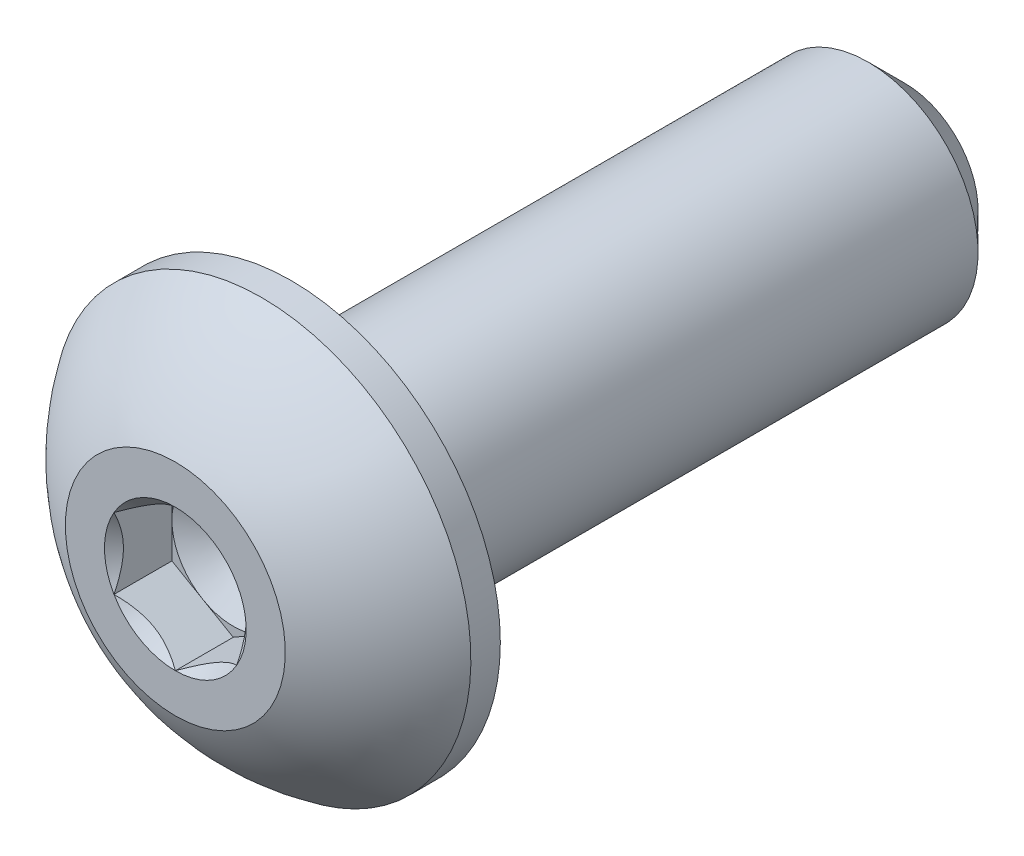
ISO-10303-21;
HEADER;
FILE_DESCRIPTION(('STEP AP214'),'2;1');
FILE_NAME('part.step','',(''),(''),'','','');
FILE_SCHEMA(('AUTOMOTIVE_DESIGN { 1 0 10303 214 1 1 1 1 }'));
ENDSEC;
DATA;
#1=APPLICATION_CONTEXT('core data for automotive mechanical design processes');
#2=APPLICATION_PROTOCOL_DEFINITION('international standard','automotive_design',2000,#1);
#3=PRODUCT_CONTEXT('',#1,'mechanical');
#4=PRODUCT('Part','Part','',(#3));
#5=PRODUCT_RELATED_PRODUCT_CATEGORY('part','',(#4));
#6=PRODUCT_DEFINITION_FORMATION('','',#4);
#7=PRODUCT_DEFINITION_CONTEXT('part definition',#1,'design');
#8=PRODUCT_DEFINITION('design','',#6,#7);
#9=PRODUCT_DEFINITION_SHAPE('','',#8);
#10=(LENGTH_UNIT() NAMED_UNIT(*) SI_UNIT(.MILLI.,.METRE.));
#11=(NAMED_UNIT(*) PLANE_ANGLE_UNIT() SI_UNIT($,.RADIAN.));
#12=(NAMED_UNIT(*) SI_UNIT($,.STERADIAN.) SOLID_ANGLE_UNIT());
#13=UNCERTAINTY_MEASURE_WITH_UNIT(LENGTH_MEASURE(1.E-05),#10,'distance_accuracy_value','');
#14=(GEOMETRIC_REPRESENTATION_CONTEXT(3) GLOBAL_UNCERTAINTY_ASSIGNED_CONTEXT((#13)) GLOBAL_UNIT_ASSIGNED_CONTEXT((#10,
#11,#12)) REPRESENTATION_CONTEXT('',''));
#15=CARTESIAN_POINT('',(0.,0.,0.));
#16=DIRECTION('',(0.,0.,1.));
#17=DIRECTION('',(1.,0.,0.));
#18=AXIS2_PLACEMENT_3D('',#15,#16,#17);
#19=CARTESIAN_POINT('',(0.79375,-1.3748153285078,0.7493));
#20=DIRECTION('',(0.,0.,1.));
#21=DIRECTION('',(1.,0.,0.));
#22=AXIS2_PLACEMENT_3D('',#19,#20,#21);
#23=PLANE('',#22);
#24=CARTESIAN_POINT('',(0.,0.,0.7493));
#25=DIRECTION('',(0.,0.,1.));
#26=DIRECTION('',(1.,0.,0.));
#27=AXIS2_PLACEMENT_3D('',#24,#25,#26);
#28=CIRCLE('',#27,0.79375);
#29=CARTESIAN_POINT('',(0.79375,0.,0.7493));
#30=VERTEX_POINT('',#29);
#31=CARTESIAN_POINT('',(0.396875,0.687407664253898,0.7493));
#32=VERTEX_POINT('',#31);
#33=EDGE_CURVE('E42',#30,#32,#28,.T.);
#34=ORIENTED_EDGE('',*,*,#33,.F.);
#35=DIRECTION('',(0.,1.,0.));
#36=VECTOR('',#35,1.);
#37=CARTESIAN_POINT('',(0.79375,-0.458271776169264,0.7493));
#38=LINE('',#37,#36);
#39=CARTESIAN_POINT('',(0.79375,0.458271776169267,0.7493));
#40=VERTEX_POINT('',#39);
#41=EDGE_CURVE('E112',#30,#40,#38,.T.);
#42=ORIENTED_EDGE('',*,*,#41,.T.);
#43=DIRECTION('',(-0.866025403784438,0.5,0.));
#44=VECTOR('',#43,1.);
#45=CARTESIAN_POINT('',(0.79375,0.458271776169267,0.7493));
#46=LINE('',#45,#44);
#47=EDGE_CURVE('E115',#40,#32,#46,.T.);
#48=ORIENTED_EDGE('',*,*,#47,.T.);
#49=EDGE_LOOP('',(#34,#42,#48));
#50=FACE_BOUND('',#49,.T.);
#51=ADVANCED_FACE('F31',(#50),#23,.T.);
#52=CARTESIAN_POINT('',(-0.396875,0.687407664253899,0.7493));
#53=VERTEX_POINT('',#52);
#54=EDGE_CURVE('E11',#32,#53,#28,.T.);
#55=ORIENTED_EDGE('',*,*,#54,.F.);
#56=CARTESIAN_POINT('',(0.,0.916543552338533,0.7493));
#57=VERTEX_POINT('',#56);
#58=EDGE_CURVE('E129',#32,#57,#46,.T.);
#59=ORIENTED_EDGE('',*,*,#58,.T.);
#60=DIRECTION('',(-0.866025403784439,-0.5,0.));
#61=VECTOR('',#60,1.);
#62=CARTESIAN_POINT('',(0.,0.916543552338533,0.7493));
#63=LINE('',#62,#61);
#64=EDGE_CURVE('E135',#57,#53,#63,.T.);
#65=ORIENTED_EDGE('',*,*,#64,.T.);
#66=EDGE_LOOP('',(#55,#59,#65));
#67=FACE_BOUND('',#66,.T.);
#68=ADVANCED_FACE('F191',(#67),#23,.T.);
#69=CARTESIAN_POINT('',(-0.79375,0.,0.7493));
#70=VERTEX_POINT('',#69);
#71=EDGE_CURVE('E40',#53,#70,#28,.T.);
#72=ORIENTED_EDGE('',*,*,#71,.F.);
#73=CARTESIAN_POINT('',(-0.79375,0.458271776169267,0.7493));
#74=VERTEX_POINT('',#73);
#75=EDGE_CURVE('E134',#53,#74,#63,.T.);
#76=ORIENTED_EDGE('',*,*,#75,.T.);
#77=DIRECTION('',(0.,-1.,0.));
#78=VECTOR('',#77,1.);
#79=CARTESIAN_POINT('',(-0.79375,0.458271776169267,0.7493));
#80=LINE('',#79,#78);
#81=EDGE_CURVE('E139',#74,#70,#80,.T.);
#82=ORIENTED_EDGE('',*,*,#81,.T.);
#83=EDGE_LOOP('',(#72,#76,#82));
#84=FACE_BOUND('',#83,.T.);
#85=ADVANCED_FACE('F196',(#84),#23,.T.);
#86=CARTESIAN_POINT('',(-0.396875,-0.687407664253898,0.7493));
#87=VERTEX_POINT('',#86);
#88=EDGE_CURVE('E226',#70,#87,#28,.T.);
#89=ORIENTED_EDGE('',*,*,#88,.F.);
#90=CARTESIAN_POINT('',(-0.79375,-0.458271776169264,0.7493));
#91=VERTEX_POINT('',#90);
#92=EDGE_CURVE('E138',#70,#91,#80,.T.);
#93=ORIENTED_EDGE('',*,*,#92,.T.);
#94=DIRECTION('',(0.866025403784439,-0.5,0.));
#95=VECTOR('',#94,1.);
#96=CARTESIAN_POINT('',(-0.79375,-0.458271776169264,0.7493));
#97=LINE('',#96,#95);
#98=EDGE_CURVE('E231',#91,#87,#97,.T.);
#99=ORIENTED_EDGE('',*,*,#98,.T.);
#100=EDGE_LOOP('',(#89,#93,#99));
#101=FACE_BOUND('',#100,.T.);
#102=ADVANCED_FACE('F214',(#101),#23,.T.);
#103=CARTESIAN_POINT('',(0.396874999999999,-0.687407664253897,0.7493));
#104=VERTEX_POINT('',#103);
#105=EDGE_CURVE('E49',#87,#104,#28,.T.);
#106=ORIENTED_EDGE('',*,*,#105,.F.);
#107=CARTESIAN_POINT('',(0.,-0.916543552338529,0.7493));
#108=VERTEX_POINT('',#107);
#109=EDGE_CURVE('E223',#87,#108,#97,.T.);
#110=ORIENTED_EDGE('',*,*,#109,.T.);
#111=DIRECTION('',(0.866025403784439,0.5,0.));
#112=VECTOR('',#111,1.);
#113=CARTESIAN_POINT('',(0.,-0.916543552338529,0.7493));
#114=LINE('',#113,#112);
#115=EDGE_CURVE('E124',#108,#104,#114,.T.);
#116=ORIENTED_EDGE('',*,*,#115,.T.);
#117=EDGE_LOOP('',(#106,#110,#116));
#118=FACE_BOUND('',#117,.T.);
#119=ADVANCED_FACE('F203',(#118),#23,.T.);
#120=CARTESIAN_POINT('',(0.,0.,0.));
#121=DIRECTION('',(0.,0.,-1.));
#122=DIRECTION('',(0.,1.,0.));
#123=AXIS2_PLACEMENT_3D('',#120,#121,#122);
#124=CYLINDRICAL_SURFACE('',#123,1.4224);
#125=CARTESIAN_POINT('',(0.,0.,-7.46125));
#126=DIRECTION('',(0.,0.,-1.));
#127=DIRECTION('',(0.,1.,0.));
#128=AXIS2_PLACEMENT_3D('',#125,#126,#127);
#129=CIRCLE('',#128,1.4224);
#130=CARTESIAN_POINT('',(0.,1.4224,-7.46125));
#131=VERTEX_POINT('',#130);
#132=EDGE_CURVE('E35',#131,#131,#129,.F.);
#133=ORIENTED_EDGE('',*,*,#132,.T.);
#134=EDGE_LOOP('',(#133));
#135=FACE_BOUND('',#134,.T.);
#136=CARTESIAN_POINT('',(0.,0.,0.));
#137=DIRECTION('',(0.,0.,1.));
#138=DIRECTION('',(1.,0.,0.));
#139=AXIS2_PLACEMENT_3D('',#136,#137,#138);
#140=CIRCLE('',#139,1.4224);
#141=CARTESIAN_POINT('',(1.4224,0.,0.));
#142=VERTEX_POINT('',#141);
#143=EDGE_CURVE('E166',#142,#142,#140,.F.);
#144=ORIENTED_EDGE('',*,*,#143,.T.);
#145=EDGE_LOOP('',(#144));
#146=FACE_BOUND('',#145,.T.);
#147=ADVANCED_FACE('F175',(#135,#146),#124,.T.);
#148=CARTESIAN_POINT('',(0.,0.,-7.9375));
#149=DIRECTION('',(0.,0.,-1.));
#150=DIRECTION('',(0.,1.,0.));
#151=AXIS2_PLACEMENT_3D('',#148,#149,#150);
#152=PLANE('',#151);
#153=CARTESIAN_POINT('',(0.,0.,-7.9375));
#154=DIRECTION('',(0.,0.,-1.));
#155=DIRECTION('',(0.,1.,0.));
#156=AXIS2_PLACEMENT_3D('',#153,#154,#155);
#157=CIRCLE('',#156,0.94615);
#158=CARTESIAN_POINT('',(0.,0.946150000000001,-7.9375));
#159=VERTEX_POINT('',#158);
#160=EDGE_CURVE('E168',#159,#159,#157,.T.);
#161=ORIENTED_EDGE('',*,*,#160,.T.);
#162=EDGE_LOOP('',(#161));
#163=FACE_BOUND('',#162,.T.);
#164=ADVANCED_FACE('F181',(#163),#152,.T.);
#165=CARTESIAN_POINT('',(0.,0.,-7.9375));
#166=DIRECTION('',(0.,0.,1.));
#167=DIRECTION('',(0.,-1.,0.));
#168=AXIS2_PLACEMENT_3D('',#165,#166,#167);
#169=CONICAL_SURFACE('',#168,0.94615,0.785398163397445);
#170=ORIENTED_EDGE('',*,*,#132,.F.);
#171=EDGE_LOOP('',(#170));
#172=FACE_BOUND('',#171,.T.);
#173=ORIENTED_EDGE('',*,*,#160,.F.);
#174=EDGE_LOOP('',(#173));
#175=FACE_BOUND('',#174,.T.);
#176=ADVANCED_FACE('F33',(#172,#175),#169,.T.);
#177=CARTESIAN_POINT('',(0.,0.,9.14977821515092));
#178=DIRECTION('',(0.,0.,-1.));
#179=DIRECTION('',(-1.,0.,0.));
#180=AXIS2_PLACEMENT_3D('',#177,#178,#179);
#181=CYLINDRICAL_SURFACE('',#180,2.7051);
#182=CARTESIAN_POINT('',(0.,0.,0.381));
#183=DIRECTION('',(0.,0.,-1.));
#184=DIRECTION('',(0.,1.,0.));
#185=AXIS2_PLACEMENT_3D('',#182,#183,#184);
#186=CIRCLE('',#185,2.7051);
#187=CARTESIAN_POINT('',(0.,2.7051,0.381));
#188=VERTEX_POINT('',#187);
#189=EDGE_CURVE('E160',#188,#188,#186,.T.);
#190=ORIENTED_EDGE('',*,*,#189,.T.);
#191=EDGE_LOOP('',(#190));
#192=FACE_BOUND('',#191,.T.);
#193=CARTESIAN_POINT('',(0.,0.,0.));
#194=DIRECTION('',(0.,0.,1.));
#195=DIRECTION('',(1.,0.,0.));
#196=AXIS2_PLACEMENT_3D('',#193,#194,#195);
#197=CIRCLE('',#196,2.7051);
#198=CARTESIAN_POINT('',(2.7051,0.,0.));
#199=VERTEX_POINT('',#198);
#200=EDGE_CURVE('E163',#199,#199,#197,.T.);
#201=ORIENTED_EDGE('',*,*,#200,.T.);
#202=EDGE_LOOP('',(#201));
#203=FACE_BOUND('',#202,.T.);
#204=ADVANCED_FACE('F180',(#192,#203),#181,.T.);
#205=CARTESIAN_POINT('',(0.,0.,0.));
#206=DIRECTION('',(0.,0.,1.));
#207=DIRECTION('',(1.,0.,0.));
#208=AXIS2_PLACEMENT_3D('',#205,#206,#207);
#209=PLANE('',#208);
#210=ORIENTED_EDGE('',*,*,#143,.F.);
#211=EDGE_LOOP('',(#210));
#212=FACE_BOUND('',#211,.T.);
#213=ORIENTED_EDGE('',*,*,#200,.F.);
#214=EDGE_LOOP('',(#213));
#215=FACE_BOUND('',#214,.T.);
#216=ADVANCED_FACE('F186',(#212,#215),#209,.F.);
#217=CARTESIAN_POINT('',(0.,0.,-1.42882215909091));
#218=DIRECTION('',(0.,0.,-1.));
#219=DIRECTION('',(0.,1.,0.));
#220=AXIS2_PLACEMENT_3D('',#217,#218,#219);
#221=SPHERICAL_SURFACE('',#220,3.25469234452912);
#222=ORIENTED_EDGE('',*,*,#189,.F.);
#223=EDGE_LOOP('',(#222));
#224=FACE_BOUND('',#223,.T.);
#225=CARTESIAN_POINT('',(0.,0.,1.4986));
#226=DIRECTION('',(0.,0.,-1.));
#227=DIRECTION('',(0.,1.,0.));
#228=AXIS2_PLACEMENT_3D('',#225,#226,#227);
#229=CIRCLE('',#228,1.4224);
#230=CARTESIAN_POINT('',(0.,1.4224,1.4986));
#231=VERTEX_POINT('',#230);
#232=EDGE_CURVE('E146',#231,#231,#229,.T.);
#233=ORIENTED_EDGE('',*,*,#232,.T.);
#234=EDGE_LOOP('',(#233));
#235=FACE_BOUND('',#234,.T.);
#236=ADVANCED_FACE('F425',(#224,#235),#221,.T.);
#237=CARTESIAN_POINT('',(0.,0.,1.4986));
#238=DIRECTION('',(0.,0.,1.));
#239=DIRECTION('',(1.,0.,0.));
#240=AXIS2_PLACEMENT_3D('',#237,#238,#239);
#241=PLANE('',#240);
#242=CARTESIAN_POINT('',(0.,0.,1.4986));
#243=DIRECTION('',(0.,0.,1.));
#244=DIRECTION('',(1.,0.,0.));
#245=AXIS2_PLACEMENT_3D('',#242,#243,#244);
#246=CIRCLE('',#245,0.916543552338529);
#247=CARTESIAN_POINT('',(0.79375,0.458271776169263,1.4986));
#248=VERTEX_POINT('',#247);
#249=CARTESIAN_POINT('',(0.,0.916543552338529,1.4986));
#250=VERTEX_POINT('',#249);
#251=EDGE_CURVE('E486',#248,#250,#246,.T.);
#252=ORIENTED_EDGE('',*,*,#251,.F.);
#253=CARTESIAN_POINT('',(0.79375,-0.458271776169264,1.4986));
#254=VERTEX_POINT('',#253);
#255=EDGE_CURVE('E490',#254,#248,#246,.T.);
#256=ORIENTED_EDGE('',*,*,#255,.F.);
#257=CARTESIAN_POINT('',(0.,-0.916543552338529,1.4986));
#258=VERTEX_POINT('',#257);
#259=EDGE_CURVE('E496',#258,#254,#246,.T.);
#260=ORIENTED_EDGE('',*,*,#259,.F.);
#261=CARTESIAN_POINT('',(-0.79375,-0.458271776169262,1.4986));
#262=VERTEX_POINT('',#261);
#263=EDGE_CURVE('E499',#262,#258,#246,.T.);
#264=ORIENTED_EDGE('',*,*,#263,.F.);
#265=CARTESIAN_POINT('',(-0.793749999999995,0.45827177616927,1.4986));
#266=VERTEX_POINT('',#265);
#267=EDGE_CURVE('E56',#266,#262,#246,.T.);
#268=ORIENTED_EDGE('',*,*,#267,.F.);
#269=EDGE_CURVE('E491',#250,#266,#246,.T.);
#270=ORIENTED_EDGE('',*,*,#269,.F.);
#271=EDGE_LOOP('',(#252,#256,#260,#264,#268,#270));
#272=FACE_BOUND('',#271,.T.);
#273=ORIENTED_EDGE('',*,*,#232,.F.);
#274=EDGE_LOOP('',(#273));
#275=FACE_BOUND('',#274,.T.);
#276=ADVANCED_FACE('F403',(#272,#275),#241,.T.);
#277=CARTESIAN_POINT('',(0.,0.,1.4986));
#278=DIRECTION('',(0.,0.,1.));
#279=DIRECTION('',(1.,0.,0.));
#280=AXIS2_PLACEMENT_3D('',#277,#278,#279);
#281=CONICAL_SURFACE('',#280,0.916543552338529,0.78539816339745);
#282=ORIENTED_EDGE('',*,*,#259,.T.);
#283=CARTESIAN_POINT('',(-0.000200000000000455,-0.916659022392367,1.4987154918722));
#284=CARTESIAN_POINT('',(0.0270936731708993,-0.900901012839974,1.48296677881996));
#285=CARTESIAN_POINT('',(0.0548437622982907,-0.884879491412239,1.46814254758418));
#286=CARTESIAN_POINT('',(0.111429749536839,-0.852209556447702,1.44099903778594));
#287=CARTESIAN_POINT('',(0.140271036646688,-0.835558031571056,1.42869487372838));
#288=CARTESIAN_POINT('',(0.198428320979554,-0.801980907806138,1.4076173665706));
#289=CARTESIAN_POINT('',(0.227729485202779,-0.78506387275429,1.39879100814755));
#290=CARTESIAN_POINT('',(0.286976842886976,-0.750857394846545,1.38519123872424));
#291=CARTESIAN_POINT('',(0.316921224361637,-0.733568998141432,1.38040766812998));
#292=CARTESIAN_POINT('',(0.368524622466451,-0.703775762354518,1.37609340945595));
#293=CARTESIAN_POINT('',(0.390116468258511,-0.691309704374172,1.37545527141097));
#294=CARTESIAN_POINT('',(0.433258367277031,-0.666401717362478,1.37652613979119));
#295=CARTESIAN_POINT('',(0.454808410236484,-0.65395979425879,1.37823566388179));
#296=CARTESIAN_POINT('',(0.519150845544782,-0.616811671913228,1.38677279115859));
#297=CARTESIAN_POINT('',(0.561623053980694,-0.592290330939676,1.39700991913679));
#298=CARTESIAN_POINT('',(0.636174390780281,-0.549248096569988,1.42171858984055));
#299=CARTESIAN_POINT('',(0.668602787817666,-0.530525552811065,1.43489617467531));
#300=CARTESIAN_POINT('',(0.732189146461483,-0.49381395153127,1.46458103995168));
#301=CARTESIAN_POINT('',(0.763350854631517,-0.475822730930892,1.48107748789317));
#302=CARTESIAN_POINT('',(0.79395,-0.458156306115426,1.4987154918722));
#303=B_SPLINE_CURVE_WITH_KNOTS('',3,(#283,#284,#285,#286,#287,#288,#289,#290,#291,#292,#293,
#294,#295,#296,#297,#298,#299,#300,#301,#302),.UNSPECIFIED.,.F.,.F.,(4,2,2,2,2,2,2,2,2,4),(0.,
0.105768699105621,0.21215429718622,0.316848842533858,0.421279499712345,0.495991864977073,
0.570720707151282,0.720221070373883,0.839150369964801,0.957697614118391),.UNSPECIFIED.);
#304=EDGE_CURVE('E256',#258,#254,#303,.T.);
#305=ORIENTED_EDGE('',*,*,#304,.F.);
#306=EDGE_LOOP('',(#282,#305));
#307=FACE_BOUND('',#306,.T.);
#308=ADVANCED_FACE('F212',(#307),#281,.F.);
#309=ORIENTED_EDGE('',*,*,#255,.T.);
#310=CARTESIAN_POINT('',(0.79375,-0.930523312873779,1.80513154686903));
#311=CARTESIAN_POINT('',(0.79375,-0.907938717568108,1.78795163801993));
#312=CARTESIAN_POINT('',(0.79375,-0.885230100372018,1.77093524884748));
#313=CARTESIAN_POINT('',(0.79375,-0.83951390138625,1.73729754968507));
#314=CARTESIAN_POINT('',(0.79375,-0.81650624817287,1.72067633686699));
#315=CARTESIAN_POINT('',(0.79375,-0.746621435652652,1.67127015014611));
#316=CARTESIAN_POINT('',(0.79375,-0.699225496572676,1.63920694226179));
#317=CARTESIAN_POINT('',(0.79375,-0.599729870318619,1.57610938356628));
#318=CARTESIAN_POINT('',(0.79375,-0.547518111602845,1.54524980287807));
#319=CARTESIAN_POINT('',(0.79375,-0.440465997521066,1.48869431939161));
#320=CARTESIAN_POINT('',(0.79375,-0.385635319588842,1.462980990208));
#321=CARTESIAN_POINT('',(0.79375,-0.303490919645501,1.43151828592316));
#322=CARTESIAN_POINT('',(0.79375,-0.277428588623871,1.42251658488986));
#323=CARTESIAN_POINT('',(0.79375,-0.224660266267594,1.40660365805206));
#324=CARTESIAN_POINT('',(0.79375,-0.197954232107697,1.39969257175189));
#325=CARTESIAN_POINT('',(0.79375,-0.144516677526958,1.38844073487269));
#326=CARTESIAN_POINT('',(0.79375,-0.117794877403843,1.38405455104384));
#327=CARTESIAN_POINT('',(0.79375,-0.0640385307880295,1.37793807645136));
#328=CARTESIAN_POINT('',(0.79375,-0.037003941658247,1.37620815217119));
#329=CARTESIAN_POINT('',(0.79375,0.0160384595788292,1.37554283034023));
#330=CARTESIAN_POINT('',(0.79375,0.0420449606060605,1.37650050108268));
#331=CARTESIAN_POINT('',(0.79375,0.093845497213574,1.38091790993338));
#332=CARTESIAN_POINT('',(0.79375,0.11963949213758,1.38437811607282));
#333=CARTESIAN_POINT('',(0.79375,0.171261622869057,1.39366770326333));
#334=CARTESIAN_POINT('',(0.79375,0.197082302323078,1.3995378826003));
#335=CARTESIAN_POINT('',(0.79375,0.248157270984135,1.4133304606982));
#336=CARTESIAN_POINT('',(0.79375,0.273411601594531,1.42125270890617));
#337=CARTESIAN_POINT('',(0.79375,0.352183480672703,1.44896346635406));
#338=CARTESIAN_POINT('',(0.79375,0.404598779993784,1.4718769639291));
#339=CARTESIAN_POINT('',(0.79375,0.506973354577988,1.5228423731992));
#340=CARTESIAN_POINT('',(0.79375,0.556923045144656,1.55091259799278));
#341=CARTESIAN_POINT('',(0.79375,0.652394168745675,1.60884556234195));
#342=CARTESIAN_POINT('',(0.79375,0.698012407471607,1.63855075951651));
#343=CARTESIAN_POINT('',(0.79375,0.765221422184928,1.68448125421725));
#344=CARTESIAN_POINT('',(0.79375,0.787334753284685,1.69995518303451));
#345=CARTESIAN_POINT('',(0.79375,0.831258721493259,1.73131476145367));
#346=CARTESIAN_POINT('',(0.79375,0.853069439825473,1.74720029716127));
#347=CARTESIAN_POINT('',(0.79375,0.874754064753108,1.76325657308564));
#348=B_SPLINE_CURVE_WITH_KNOTS('',3,(#310,#311,#312,#313,#314,#315,#316,#317,#318,#319,#320,
#321,#322,#323,#324,#325,#326,#327,#328,#329,#330,#331,#332,#333,#334,#335,#336,#337,#338,#339,
#340,#341,#342,#343,#344,#345,#346,#347),.UNSPECIFIED.,.F.,.F.,(4,2,2,2,2,2,2,2,2,2,2,2,2,2,2,2,
2,2,4),(0.,0.0851267212699211,0.170274162697199,0.341867540062669,0.523672188154065,
0.704850381262152,0.787500098686151,0.870155330015478,0.951272603586192,1.03240106788106,
1.11034793766582,1.18830938906372,1.26764895162694,1.34698269497801,1.51809534529198,
1.68982784691028,1.85305831881697,1.93402417500375,2.01496786175293),.UNSPECIFIED.);
#349=EDGE_CURVE('E264',#254,#248,#348,.T.);
#350=ORIENTED_EDGE('',*,*,#349,.F.);
#351=EDGE_LOOP('',(#309,#350));
#352=FACE_BOUND('',#351,.T.);
#353=ADVANCED_FACE('F388',(#352),#281,.F.);
#354=ORIENTED_EDGE('',*,*,#251,.T.);
#355=CARTESIAN_POINT('',(0.793949999999999,0.458156306115429,1.4987154918722));
#356=CARTESIAN_POINT('',(0.7666563268291,0.473914315667822,1.48296677881996));
#357=CARTESIAN_POINT('',(0.738906237701709,0.489935837095558,1.46814254758418));
#358=CARTESIAN_POINT('',(0.68232025046316,0.522605772060094,1.44099903778594));
#359=CARTESIAN_POINT('',(0.653478963353312,0.53925729693674,1.42869487372838));
#360=CARTESIAN_POINT('',(0.595321679020446,0.572834420701658,1.4076173665706));
#361=CARTESIAN_POINT('',(0.566020514797221,0.589751455753507,1.39879100814755));
#362=CARTESIAN_POINT('',(0.506773157113025,0.623957933661252,1.38519123872424));
#363=CARTESIAN_POINT('',(0.476828775638364,0.641246330366364,1.38040766812999));
#364=CARTESIAN_POINT('',(0.425225377533549,0.671039566153278,1.37609340945595));
#365=CARTESIAN_POINT('',(0.40363353174149,0.683505624133624,1.37545527141097));
#366=CARTESIAN_POINT('',(0.360491632722969,0.708413611145319,1.3765261397912));
#367=CARTESIAN_POINT('',(0.338941589763516,0.720855534249007,1.37823566388179));
#368=CARTESIAN_POINT('',(0.274599154455218,0.758003656594569,1.3867727911586));
#369=CARTESIAN_POINT('',(0.232126946019306,0.782524997568121,1.3970099191368));
#370=CARTESIAN_POINT('',(0.157575609219719,0.825567231937809,1.42171858984055));
#371=CARTESIAN_POINT('',(0.125147212182333,0.844289775696731,1.43489617467531));
#372=CARTESIAN_POINT('',(0.0615608535385166,0.881001376976527,1.46458103995168));
#373=CARTESIAN_POINT('',(0.0303991453684829,0.898992597576905,1.48107748789317));
#374=CARTESIAN_POINT('',(-0.000200000000000255,0.916659022392371,1.4987154918722));
#375=B_SPLINE_CURVE_WITH_KNOTS('',3,(#355,#356,#357,#358,#359,#360,#361,#362,#363,#364,#365,
#366,#367,#368,#369,#370,#371,#372,#373,#374),.UNSPECIFIED.,.F.,.F.,(4,2,2,2,2,2,2,2,2,4),(0.,
0.105768699105621,0.212154297186219,0.316848842533857,0.421279499712344,0.495991864977072,
0.570720707151281,0.720221070373882,0.8391503699648,0.957697614118391),.UNSPECIFIED.);
#376=EDGE_CURVE('E271',#248,#250,#375,.T.);
#377=ORIENTED_EDGE('',*,*,#376,.F.);
#378=EDGE_LOOP('',(#354,#377));
#379=FACE_BOUND('',#378,.T.);
#380=ADVANCED_FACE('F380',(#379),#281,.F.);
#381=ORIENTED_EDGE('',*,*,#269,.T.);
#382=CARTESIAN_POINT('',(0.00019999999999984,0.916659022392371,1.4987154918722));
#383=CARTESIAN_POINT('',(-0.0270936731709001,0.900901012839978,1.48296677881996));
#384=CARTESIAN_POINT('',(-0.0548437622982915,0.884879491412243,1.46814254758418));
#385=CARTESIAN_POINT('',(-0.11142974953684,0.852209556447706,1.44099903778594));
#386=CARTESIAN_POINT('',(-0.140271036646689,0.835558031571059,1.42869487372838));
#387=CARTESIAN_POINT('',(-0.198428320979556,0.801980907806141,1.4076173665706));
#388=CARTESIAN_POINT('',(-0.22772948520278,0.785063872754293,1.39879100814755));
#389=CARTESIAN_POINT('',(-0.286976842886977,0.750857394846548,1.38519123872424));
#390=CARTESIAN_POINT('',(-0.316921224361638,0.733568998141436,1.38040766812999));
#391=CARTESIAN_POINT('',(-0.368524622466453,0.703775762354521,1.37609340945595));
#392=CARTESIAN_POINT('',(-0.390116468258512,0.691309704374175,1.37545527141097));
#393=CARTESIAN_POINT('',(-0.433258367277033,0.666401717362481,1.3765261397912));
#394=CARTESIAN_POINT('',(-0.454808410236486,0.653959794258792,1.37823566388179));
#395=CARTESIAN_POINT('',(-0.519150845544784,0.61681167191323,1.3867727911586));
#396=CARTESIAN_POINT('',(-0.561623053980697,0.592290330939678,1.3970099191368));
#397=CARTESIAN_POINT('',(-0.636174390780283,0.549248096569991,1.42171858984055));
#398=CARTESIAN_POINT('',(-0.668602787817668,0.530525552811068,1.43489617467531));
#399=CARTESIAN_POINT('',(-0.732189146461484,0.493813951531273,1.46458103995168));
#400=CARTESIAN_POINT('',(-0.763350854631517,0.475822730930895,1.48107748789317));
#401=CARTESIAN_POINT('',(-0.79395,0.45815630611543,1.4987154918722));
#402=B_SPLINE_CURVE_WITH_KNOTS('',3,(#382,#383,#384,#385,#386,#387,#388,#389,#390,#391,#392,
#393,#394,#395,#396,#397,#398,#399,#400,#401),.UNSPECIFIED.,.F.,.F.,(4,2,2,2,2,2,2,2,2,4),(0.,
0.105768699105622,0.21215429718622,0.316848842533859,0.421279499712347,0.495991864977074,
0.570720707151284,0.720221070373885,0.839150369964802,0.957697614118391),.UNSPECIFIED.);
#403=EDGE_CURVE('E276',#250,#266,#402,.T.);
#404=ORIENTED_EDGE('',*,*,#403,.F.);
#405=EDGE_LOOP('',(#381,#404));
#406=FACE_BOUND('',#405,.T.);
#407=ADVANCED_FACE('F373',(#406),#281,.F.);
#408=ORIENTED_EDGE('',*,*,#267,.T.);
#409=CARTESIAN_POINT('',(-0.79375,-0.930523312845418,1.80513154684746));
#410=CARTESIAN_POINT('',(-0.79375,-0.907938717540552,1.78795163799919));
#411=CARTESIAN_POINT('',(-0.79375,-0.88523010034527,1.77093524882756));
#412=CARTESIAN_POINT('',(-0.79375,-0.839513901361125,1.73729754966682));
#413=CARTESIAN_POINT('',(-0.79375,-0.816506248148561,1.72067633684956));
#414=CARTESIAN_POINT('',(-0.79375,-0.746621435630839,1.67127015013118));
#415=CARTESIAN_POINT('',(-0.79375,-0.69922549655256,1.63920694224851));
#416=CARTESIAN_POINT('',(-0.79375,-0.599729870302204,1.57610938355642));
#417=CARTESIAN_POINT('',(-0.79375,-0.547518111588444,1.54524980286995));
#418=CARTESIAN_POINT('',(-0.79375,-0.440465997510864,1.48869431938673));
#419=CARTESIAN_POINT('',(-0.79375,-0.385635319580823,1.46298099020461));
#420=CARTESIAN_POINT('',(-0.79375,-0.30349091963912,1.43151828592086));
#421=CARTESIAN_POINT('',(-0.79375,-0.277428588616795,1.4225165848875));
#422=CARTESIAN_POINT('',(-0.79375,-0.224660266259103,1.40660365804972));
#423=CARTESIAN_POINT('',(-0.79375,-0.197954232098486,1.39969257174964));
#424=CARTESIAN_POINT('',(-0.79375,-0.144516677516331,1.38844073487076));
#425=CARTESIAN_POINT('',(-0.79375,-0.11779487739252,1.38405455104215));
#426=CARTESIAN_POINT('',(-0.79375,-0.0640385307753352,1.37793807645032));
#427=CARTESIAN_POINT('',(-0.79375,-0.0370039416448776,1.37620815217055));
#428=CARTESIAN_POINT('',(-0.79375,0.0160384595934048,1.37554283034051));
#429=CARTESIAN_POINT('',(-0.79375,0.0420449606211689,1.37650050108347));
#430=CARTESIAN_POINT('',(-0.79375,0.0938454972296932,1.38091790993526));
#431=CARTESIAN_POINT('',(-0.79375,0.119639492154177,1.38437811607528));
#432=CARTESIAN_POINT('',(-0.79375,0.171261622886597,1.39366770326701));
#433=CARTESIAN_POINT('',(-0.79375,0.197082302341082,1.39953788260463));
#434=CARTESIAN_POINT('',(-0.79375,0.24815727100302,1.41333046070383));
#435=CARTESIAN_POINT('',(-0.79375,0.273411601613832,1.42125270891245));
#436=CARTESIAN_POINT('',(-0.793750000000001,0.352183480696166,1.44896346636341));
#437=CARTESIAN_POINT('',(-0.79375,0.404598780020782,1.47187696394126));
#438=CARTESIAN_POINT('',(-0.79375,0.506973354611786,1.52284237321731));
#439=CARTESIAN_POINT('',(-0.79375,0.556923045181717,1.55091259801402));
#440=CARTESIAN_POINT('',(-0.79375,0.652394168788597,1.60884556236918));
#441=CARTESIAN_POINT('',(-0.793750000000001,0.69801240751715,1.63855075954657));
#442=CARTESIAN_POINT('',(-0.793750000000001,0.765221422234345,1.68448125425154));
#443=CARTESIAN_POINT('',(-0.793750000000001,0.787334753335375,1.69995518307021));
#444=CARTESIAN_POINT('',(-0.793750000000001,0.831258721546487,1.73131476149216));
#445=CARTESIAN_POINT('',(-0.793750000000001,0.853069439879965,1.74720029720116));
#446=CARTESIAN_POINT('',(-0.793750000000001,0.874754064808862,1.76325657312693));
#447=B_SPLINE_CURVE_WITH_KNOTS('',3,(#409,#410,#411,#412,#413,#414,#415,#416,#417,#418,#419,
#420,#421,#422,#423,#424,#425,#426,#427,#428,#429,#430,#431,#432,#433,#434,#435,#436,#437,#438,
#439,#440,#441,#442,#443,#444,#445,#446),.UNSPECIFIED.,.F.,.F.,(4,2,2,2,2,2,2,2,2,2,2,2,2,2,2,2,
2,2,4),(0.,0.085126721266486,0.170274162690328,0.341867540048798,0.523672188132332,
0.704850381232633,0.787500098658654,0.87015532999,0.951272603562646,1.03240106785945,
1.11034793764585,1.1883093890454,1.26764895161041,1.34698269496326,1.51809534529028,
1.68982784692171,1.85305831883963,1.93402417503194,2.01496786178666),.UNSPECIFIED.);
#448=EDGE_CURVE('E243',#266,#262,#447,.F.);
#449=ORIENTED_EDGE('',*,*,#448,.F.);
#450=EDGE_LOOP('',(#408,#449));
#451=FACE_BOUND('',#450,.T.);
#452=ADVANCED_FACE('F210',(#451),#281,.F.);
#453=ORIENTED_EDGE('',*,*,#263,.T.);
#454=CARTESIAN_POINT('',(-0.79395,-0.458156306115426,1.4987154918722));
#455=CARTESIAN_POINT('',(-0.7666563268291,-0.473914315667819,1.48296677881996));
#456=CARTESIAN_POINT('',(-0.738906237701709,-0.489935837095554,1.46814254758418));
#457=CARTESIAN_POINT('',(-0.68232025046316,-0.522605772060091,1.44099903778594));
#458=CARTESIAN_POINT('',(-0.653478963353312,-0.539257296936738,1.42869487372838));
#459=CARTESIAN_POINT('',(-0.595321679020445,-0.572834420701656,1.4076173665706));
#460=CARTESIAN_POINT('',(-0.56602051479722,-0.589751455753504,1.39879100814755));
#461=CARTESIAN_POINT('',(-0.506773157113023,-0.623957933661249,1.38519123872424));
#462=CARTESIAN_POINT('',(-0.476828775638362,-0.641246330366361,1.38040766812998));
#463=CARTESIAN_POINT('',(-0.425225377533547,-0.671039566153276,1.37609340945595));
#464=CARTESIAN_POINT('',(-0.403633531741488,-0.683505624133622,1.37545527141097));
#465=CARTESIAN_POINT('',(-0.360491632722968,-0.708413611145316,1.37652613979119));
#466=CARTESIAN_POINT('',(-0.338941589763515,-0.720855534249005,1.37823566388179));
#467=CARTESIAN_POINT('',(-0.274599154455217,-0.758003656594566,1.38677279115859));
#468=CARTESIAN_POINT('',(-0.232126946019305,-0.782524997568118,1.39700991913679));
#469=CARTESIAN_POINT('',(-0.157575609219718,-0.825567231937806,1.42171858984055));
#470=CARTESIAN_POINT('',(-0.125147212182333,-0.844289775696729,1.43489617467531));
#471=CARTESIAN_POINT('',(-0.0615608535385167,-0.881001376976524,1.46458103995168));
#472=CARTESIAN_POINT('',(-0.0303991453684834,-0.898992597576901,1.48107748789317));
#473=CARTESIAN_POINT('',(0.000199999999999513,-0.916659022392367,1.4987154918722));
#474=B_SPLINE_CURVE_WITH_KNOTS('',3,(#454,#455,#456,#457,#458,#459,#460,#461,#462,#463,#464,
#465,#466,#467,#468,#469,#470,#471,#472,#473),.UNSPECIFIED.,.F.,.F.,(4,2,2,2,2,2,2,2,2,4),(0.,
0.105768699105621,0.21215429718622,0.316848842533859,0.421279499712347,0.495991864977074,
0.570720707151284,0.720221070373884,0.839150369964802,0.957697614118391),.UNSPECIFIED.);
#475=EDGE_CURVE('E233',#262,#258,#474,.T.);
#476=ORIENTED_EDGE('',*,*,#475,.F.);
#477=EDGE_LOOP('',(#453,#476));
#478=FACE_BOUND('',#477,.T.);
#479=ADVANCED_FACE('F202',(#478),#281,.F.);
#480=EDGE_CURVE('E102',#104,#30,#28,.T.);
#481=ORIENTED_EDGE('',*,*,#480,.F.);
#482=CARTESIAN_POINT('',(0.79375,-0.458271776169264,0.7493));
#483=VERTEX_POINT('',#482);
#484=EDGE_CURVE('E127',#104,#483,#114,.T.);
#485=ORIENTED_EDGE('',*,*,#484,.T.);
#486=EDGE_CURVE('E120',#483,#30,#38,.T.);
#487=ORIENTED_EDGE('',*,*,#486,.T.);
#488=EDGE_LOOP('',(#481,#485,#487));
#489=FACE_BOUND('',#488,.T.);
#490=ADVANCED_FACE('F126',(#489),#23,.T.);
#491=CARTESIAN_POINT('',(0.,-0.916543552338529,0.7493));
#492=DIRECTION('',(0.5,-0.866025403784439,0.));
#493=DIRECTION('',(0.866025403784439,0.5,0.));
#494=AXIS2_PLACEMENT_3D('',#491,#492,#493);
#495=PLANE('',#494);
#496=DIRECTION('',(0.,0.,1.));
#497=VECTOR('',#496,1.);
#498=CARTESIAN_POINT('',(0.,-0.916543552338529,0.7493));
#499=LINE('',#498,#497);
#500=EDGE_CURVE('E142',#108,#258,#499,.T.);
#501=ORIENTED_EDGE('',*,*,#500,.T.);
#502=ORIENTED_EDGE('',*,*,#304,.T.);
#503=DIRECTION('',(0.,0.,1.));
#504=VECTOR('',#503,1.);
#505=CARTESIAN_POINT('',(0.79375,-0.458271776169264,0.7493));
#506=LINE('',#505,#504);
#507=EDGE_CURVE('E154',#483,#254,#506,.T.);
#508=ORIENTED_EDGE('',*,*,#507,.F.);
#509=ORIENTED_EDGE('',*,*,#484,.F.);
#510=ORIENTED_EDGE('',*,*,#115,.F.);
#511=EDGE_LOOP('',(#501,#502,#508,#509,#510));
#512=FACE_BOUND('',#511,.T.);
#513=ADVANCED_FACE('F201',(#512),#495,.F.);
#514=CARTESIAN_POINT('',(0.79375,-0.458271776169264,0.7493));
#515=DIRECTION('',(1.,0.,0.));
#516=DIRECTION('',(0.,1.,0.));
#517=AXIS2_PLACEMENT_3D('',#514,#515,#516);
#518=PLANE('',#517);
#519=ORIENTED_EDGE('',*,*,#507,.T.);
#520=ORIENTED_EDGE('',*,*,#349,.T.);
#521=DIRECTION('',(0.,0.,1.));
#522=VECTOR('',#521,1.);
#523=CARTESIAN_POINT('',(0.79375,0.458271776169267,0.7493));
#524=LINE('',#523,#522);
#525=EDGE_CURVE('E123',#40,#248,#524,.T.);
#526=ORIENTED_EDGE('',*,*,#525,.F.);
#527=ORIENTED_EDGE('',*,*,#41,.F.);
#528=ORIENTED_EDGE('',*,*,#486,.F.);
#529=EDGE_LOOP('',(#519,#520,#526,#527,#528));
#530=FACE_BOUND('',#529,.T.);
#531=ADVANCED_FACE('F119',(#530),#518,.F.);
#532=CARTESIAN_POINT('',(0.79375,0.458271776169267,0.7493));
#533=DIRECTION('',(0.5,0.866025403784439,0.));
#534=DIRECTION('',(-0.866025403784439,0.5,0.));
#535=AXIS2_PLACEMENT_3D('',#532,#533,#534);
#536=PLANE('',#535);
#537=ORIENTED_EDGE('',*,*,#525,.T.);
#538=ORIENTED_EDGE('',*,*,#376,.T.);
#539=DIRECTION('',(0.,0.,1.));
#540=VECTOR('',#539,1.);
#541=CARTESIAN_POINT('',(0.,0.916543552338533,0.7493));
#542=LINE('',#541,#540);
#543=EDGE_CURVE('E150',#57,#250,#542,.T.);
#544=ORIENTED_EDGE('',*,*,#543,.F.);
#545=ORIENTED_EDGE('',*,*,#58,.F.);
#546=ORIENTED_EDGE('',*,*,#47,.F.);
#547=EDGE_LOOP('',(#537,#538,#544,#545,#546));
#548=FACE_BOUND('',#547,.T.);
#549=ADVANCED_FACE('F286',(#548),#536,.F.);
#550=CARTESIAN_POINT('',(0.,0.916543552338533,0.7493));
#551=DIRECTION('',(-0.5,0.866025403784439,0.));
#552=DIRECTION('',(-0.866025403784439,-0.5,0.));
#553=AXIS2_PLACEMENT_3D('',#550,#551,#552);
#554=PLANE('',#553);
#555=ORIENTED_EDGE('',*,*,#543,.T.);
#556=ORIENTED_EDGE('',*,*,#403,.T.);
#557=DIRECTION('',(0.,0.,1.));
#558=VECTOR('',#557,1.);
#559=CARTESIAN_POINT('',(-0.79375,0.458271776169267,0.7493));
#560=LINE('',#559,#558);
#561=EDGE_CURVE('E147',#74,#266,#560,.T.);
#562=ORIENTED_EDGE('',*,*,#561,.F.);
#563=ORIENTED_EDGE('',*,*,#75,.F.);
#564=ORIENTED_EDGE('',*,*,#64,.F.);
#565=EDGE_LOOP('',(#555,#556,#562,#563,#564));
#566=FACE_BOUND('',#565,.T.);
#567=ADVANCED_FACE('F282',(#566),#554,.F.);
#568=CARTESIAN_POINT('',(-0.79375,0.458271776169267,0.7493));
#569=DIRECTION('',(-1.,0.,0.));
#570=DIRECTION('',(0.,-1.,0.));
#571=AXIS2_PLACEMENT_3D('',#568,#569,#570);
#572=PLANE('',#571);
#573=ORIENTED_EDGE('',*,*,#561,.T.);
#574=ORIENTED_EDGE('',*,*,#448,.T.);
#575=DIRECTION('',(0.,0.,1.));
#576=VECTOR('',#575,1.);
#577=CARTESIAN_POINT('',(-0.79375,-0.458271776169264,0.7493));
#578=LINE('',#577,#576);
#579=EDGE_CURVE('E143',#91,#262,#578,.T.);
#580=ORIENTED_EDGE('',*,*,#579,.F.);
#581=ORIENTED_EDGE('',*,*,#92,.F.);
#582=ORIENTED_EDGE('',*,*,#81,.F.);
#583=EDGE_LOOP('',(#573,#574,#580,#581,#582));
#584=FACE_BOUND('',#583,.T.);
#585=ADVANCED_FACE('F285',(#584),#572,.F.);
#586=CARTESIAN_POINT('',(-0.79375,-0.458271776169264,0.7493));
#587=DIRECTION('',(-0.5,-0.866025403784439,0.));
#588=DIRECTION('',(0.866025403784439,-0.5,0.));
#589=AXIS2_PLACEMENT_3D('',#586,#587,#588);
#590=PLANE('',#589);
#591=ORIENTED_EDGE('',*,*,#579,.T.);
#592=ORIENTED_EDGE('',*,*,#475,.T.);
#593=ORIENTED_EDGE('',*,*,#500,.F.);
#594=ORIENTED_EDGE('',*,*,#109,.F.);
#595=ORIENTED_EDGE('',*,*,#98,.F.);
#596=EDGE_LOOP('',(#591,#592,#593,#594,#595));
#597=FACE_BOUND('',#596,.T.);
#598=ADVANCED_FACE('F230',(#597),#590,.F.);
#599=CARTESIAN_POINT('',(0.,0.,0.7493));
#600=DIRECTION('',(0.,0.,1.));
#601=DIRECTION('',(1.,0.,0.));
#602=AXIS2_PLACEMENT_3D('',#599,#600,#601);
#603=CONICAL_SURFACE('',#602,0.79375,1.0471975511966);
#604=CARTESIAN_POINT('',(0.,0.,0.499533333333333));
#605=DIRECTION('',(0.,0.,1.));
#606=DIRECTION('',(1.,0.,0.));
#607=AXIS2_PLACEMENT_3D('',#604,#605,#606);
#608=CIRCLE('',#607,0.361141443296211);
#609=CARTESIAN_POINT('',(0.361141443296211,0.,0.499533333333333));
#610=VERTEX_POINT('',#609);
#611=EDGE_CURVE('E116',#610,#610,#608,.T.);
#612=ORIENTED_EDGE('',*,*,#611,.F.);
#613=EDGE_LOOP('',(#612));
#614=FACE_BOUND('',#613,.T.);
#615=ORIENTED_EDGE('',*,*,#33,.T.);
#616=ORIENTED_EDGE('',*,*,#54,.T.);
#617=ORIENTED_EDGE('',*,*,#71,.T.);
#618=ORIENTED_EDGE('',*,*,#88,.T.);
#619=ORIENTED_EDGE('',*,*,#105,.T.);
#620=ORIENTED_EDGE('',*,*,#480,.T.);
#621=EDGE_LOOP('',(#615,#616,#617,#618,#619,#620));
#622=FACE_BOUND('',#621,.T.);
#623=ADVANCED_FACE('F104',(#614,#622),#603,.F.);
#624=CARTESIAN_POINT('',(0.,0.,0.499533333333333));
#625=DIRECTION('',(0.,0.,1.));
#626=DIRECTION('',(1.,0.,0.));
#627=AXIS2_PLACEMENT_3D('',#624,#625,#626);
#628=PLANE('',#627);
#629=ORIENTED_EDGE('',*,*,#611,.T.);
#630=EDGE_LOOP('',(#629));
#631=FACE_BOUND('',#630,.T.);
#632=ADVANCED_FACE('F324',(#631),#628,.T.);
#633=CLOSED_SHELL('',(#51,#68,#85,#102,#119,#147,#164,#176,#204,#216,#236,#276,#308,#353,#380,
#407,#452,#479,#490,#513,#531,#549,#567,#585,#598,#623,#632));
#634=MANIFOLD_SOLID_BREP('B2',#633);
#635=ADVANCED_BREP_SHAPE_REPRESENTATION('',(#18,#634),#14);
#636=SHAPE_DEFINITION_REPRESENTATION(#9,#635);
ENDSEC;
END-ISO-10303-21;
